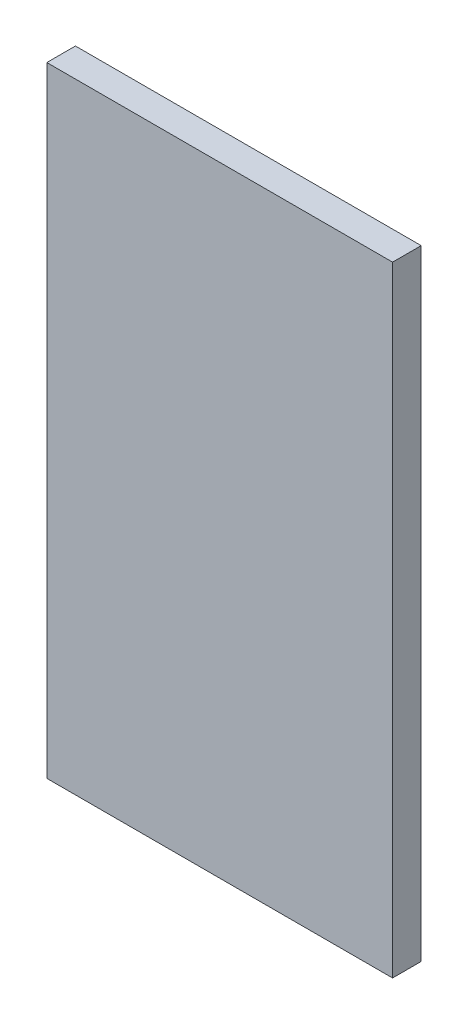
ISO-10303-21;
HEADER;
FILE_DESCRIPTION(('STEP AP214'),'2;1');
FILE_NAME('part.step','',(''),(''),'','','');
FILE_SCHEMA(('AUTOMOTIVE_DESIGN { 1 0 10303 214 1 1 1 1 }'));
ENDSEC;
DATA;
#1=APPLICATION_CONTEXT('core data for automotive mechanical design processes');
#2=APPLICATION_PROTOCOL_DEFINITION('international standard','automotive_design',2000,#1);
#3=PRODUCT_CONTEXT('',#1,'mechanical');
#4=PRODUCT('Part','Part','',(#3));
#5=PRODUCT_RELATED_PRODUCT_CATEGORY('part','',(#4));
#6=PRODUCT_DEFINITION_FORMATION('','',#4);
#7=PRODUCT_DEFINITION_CONTEXT('part definition',#1,'design');
#8=PRODUCT_DEFINITION('design','',#6,#7);
#9=PRODUCT_DEFINITION_SHAPE('','',#8);
#10=(LENGTH_UNIT() NAMED_UNIT(*) SI_UNIT(.MILLI.,.METRE.));
#11=(NAMED_UNIT(*) PLANE_ANGLE_UNIT() SI_UNIT($,.RADIAN.));
#12=(NAMED_UNIT(*) SI_UNIT($,.STERADIAN.) SOLID_ANGLE_UNIT());
#13=UNCERTAINTY_MEASURE_WITH_UNIT(LENGTH_MEASURE(1.E-05),#10,'distance_accuracy_value','');
#14=(GEOMETRIC_REPRESENTATION_CONTEXT(3) GLOBAL_UNCERTAINTY_ASSIGNED_CONTEXT((#13)) GLOBAL_UNIT_ASSIGNED_CONTEXT((#10,
#11,#12)) REPRESENTATION_CONTEXT('',''));
#15=CARTESIAN_POINT('',(0.,0.,0.));
#16=DIRECTION('',(0.,0.,1.));
#17=DIRECTION('',(1.,0.,0.));
#18=AXIS2_PLACEMENT_3D('',#15,#16,#17);
#19=CARTESIAN_POINT('',(-10.0658943507042,33.6236969127037,0.762));
#20=DIRECTION('',(-1.,0.,0.));
#21=DIRECTION('',(0.,-1.,0.));
#22=AXIS2_PLACEMENT_3D('',#19,#20,#21);
#23=PLANE('',#22);
#24=DIRECTION('',(0.,1.,0.));
#25=VECTOR('',#24,1.);
#26=CARTESIAN_POINT('',(-10.0658943507042,33.6236969127037,0.));
#27=LINE('',#26,#25);
#28=CARTESIAN_POINT('',(-10.0658943507042,33.6236969127037,0.));
#29=VERTEX_POINT('',#28);
#30=CARTESIAN_POINT('',(-10.0658943507042,50.1336969127035,0.));
#31=VERTEX_POINT('',#30);
#32=EDGE_CURVE('E95',#29,#31,#27,.T.);
#33=ORIENTED_EDGE('',*,*,#32,.T.);
#34=DIRECTION('',(0.,0.,-1.));
#35=VECTOR('',#34,1.);
#36=CARTESIAN_POINT('',(-10.0658943507042,50.1336969127035,0.762));
#37=LINE('',#36,#35);
#38=CARTESIAN_POINT('',(-10.0658943507042,50.1336969127035,0.762));
#39=VERTEX_POINT('',#38);
#40=EDGE_CURVE('E11',#39,#31,#37,.T.);
#41=ORIENTED_EDGE('',*,*,#40,.F.);
#42=DIRECTION('',(0.,1.,0.));
#43=VECTOR('',#42,1.);
#44=CARTESIAN_POINT('',(-10.0658943507042,33.6236969127037,0.762));
#45=LINE('',#44,#43);
#46=CARTESIAN_POINT('',(-10.0658943507042,33.6236969127037,0.762));
#47=VERTEX_POINT('',#46);
#48=EDGE_CURVE('E83',#47,#39,#45,.T.);
#49=ORIENTED_EDGE('',*,*,#48,.F.);
#50=DIRECTION('',(0.,0.,-1.));
#51=VECTOR('',#50,1.);
#52=CARTESIAN_POINT('',(-10.0658943507042,33.6236969127037,0.762));
#53=LINE('',#52,#51);
#54=EDGE_CURVE('E91',#47,#29,#53,.T.);
#55=ORIENTED_EDGE('',*,*,#54,.T.);
#56=EDGE_LOOP('',(#33,#41,#49,#55));
#57=FACE_BOUND('',#56,.T.);
#58=ADVANCED_FACE('F32',(#57),#23,.F.);
#59=CARTESIAN_POINT('',(-10.0658943507042,50.1336969127035,0.762));
#60=DIRECTION('',(0.,-1.,0.));
#61=DIRECTION('',(0.,0.,-1.));
#62=AXIS2_PLACEMENT_3D('',#59,#60,#61);
#63=PLANE('',#62);
#64=DIRECTION('',(-1.,0.,0.));
#65=VECTOR('',#64,1.);
#66=CARTESIAN_POINT('',(-10.0658943507042,50.1336969127035,0.));
#67=LINE('',#66,#65);
#68=CARTESIAN_POINT('',(-19.2733943507042,50.1336969127035,0.));
#69=VERTEX_POINT('',#68);
#70=EDGE_CURVE('E87',#31,#69,#67,.T.);
#71=ORIENTED_EDGE('',*,*,#70,.T.);
#72=DIRECTION('',(0.,0.,-1.));
#73=VECTOR('',#72,1.);
#74=CARTESIAN_POINT('',(-19.2733943507042,50.1336969127035,0.762));
#75=LINE('',#74,#73);
#76=CARTESIAN_POINT('',(-19.2733943507042,50.1336969127035,0.762));
#77=VERTEX_POINT('',#76);
#78=EDGE_CURVE('E40',#77,#69,#75,.T.);
#79=ORIENTED_EDGE('',*,*,#78,.F.);
#80=DIRECTION('',(-1.,0.,0.));
#81=VECTOR('',#80,1.);
#82=CARTESIAN_POINT('',(-10.0658943507042,50.1336969127035,0.762));
#83=LINE('',#82,#81);
#84=EDGE_CURVE('E78',#39,#77,#83,.T.);
#85=ORIENTED_EDGE('',*,*,#84,.F.);
#86=ORIENTED_EDGE('',*,*,#40,.T.);
#87=EDGE_LOOP('',(#71,#79,#85,#86));
#88=FACE_BOUND('',#87,.T.);
#89=ADVANCED_FACE('F86',(#88),#63,.F.);
#90=CARTESIAN_POINT('',(-19.2733943507042,50.1336969127035,0.762));
#91=DIRECTION('',(1.,0.,0.));
#92=DIRECTION('',(0.,0.,-1.));
#93=AXIS2_PLACEMENT_3D('',#90,#91,#92);
#94=PLANE('',#93);
#95=DIRECTION('',(0.,-1.,0.));
#96=VECTOR('',#95,1.);
#97=CARTESIAN_POINT('',(-19.2733943507042,50.1336969127035,0.));
#98=LINE('',#97,#96);
#99=CARTESIAN_POINT('',(-19.2733943507042,33.6236969127037,0.));
#100=VERTEX_POINT('',#99);
#101=EDGE_CURVE('E65',#69,#100,#98,.T.);
#102=ORIENTED_EDGE('',*,*,#101,.T.);
#103=DIRECTION('',(0.,0.,-1.));
#104=VECTOR('',#103,1.);
#105=CARTESIAN_POINT('',(-19.2733943507042,33.6236969127037,0.762));
#106=LINE('',#105,#104);
#107=CARTESIAN_POINT('',(-19.2733943507042,33.6236969127037,0.762));
#108=VERTEX_POINT('',#107);
#109=EDGE_CURVE('E88',#108,#100,#106,.T.);
#110=ORIENTED_EDGE('',*,*,#109,.F.);
#111=DIRECTION('',(0.,-1.,0.));
#112=VECTOR('',#111,1.);
#113=CARTESIAN_POINT('',(-19.2733943507042,50.1336969127035,0.762));
#114=LINE('',#113,#112);
#115=EDGE_CURVE('E81',#77,#108,#114,.T.);
#116=ORIENTED_EDGE('',*,*,#115,.F.);
#117=ORIENTED_EDGE('',*,*,#78,.T.);
#118=EDGE_LOOP('',(#102,#110,#116,#117));
#119=FACE_BOUND('',#118,.T.);
#120=ADVANCED_FACE('F89',(#119),#94,.F.);
#121=CARTESIAN_POINT('',(-19.2733943507042,33.6236969127037,0.762));
#122=DIRECTION('',(0.,1.,0.));
#123=DIRECTION('',(0.,0.,1.));
#124=AXIS2_PLACEMENT_3D('',#121,#122,#123);
#125=PLANE('',#124);
#126=DIRECTION('',(1.,0.,0.));
#127=VECTOR('',#126,1.);
#128=CARTESIAN_POINT('',(-19.2733943507042,33.6236969127037,0.));
#129=LINE('',#128,#127);
#130=EDGE_CURVE('E71',#100,#29,#129,.T.);
#131=ORIENTED_EDGE('',*,*,#130,.T.);
#132=ORIENTED_EDGE('',*,*,#54,.F.);
#133=DIRECTION('',(1.,0.,0.));
#134=VECTOR('',#133,1.);
#135=CARTESIAN_POINT('',(-19.2733943507042,33.6236969127037,0.762));
#136=LINE('',#135,#134);
#137=EDGE_CURVE('E48',#108,#47,#136,.T.);
#138=ORIENTED_EDGE('',*,*,#137,.F.);
#139=ORIENTED_EDGE('',*,*,#109,.T.);
#140=EDGE_LOOP('',(#131,#132,#138,#139));
#141=FACE_BOUND('',#140,.T.);
#142=ADVANCED_FACE('F102',(#141),#125,.F.);
#143=CARTESIAN_POINT('',(0.,0.,0.762));
#144=DIRECTION('',(0.,0.,1.));
#145=DIRECTION('',(1.,0.,0.));
#146=AXIS2_PLACEMENT_3D('',#143,#144,#145);
#147=PLANE('',#146);
#148=ORIENTED_EDGE('',*,*,#48,.T.);
#149=ORIENTED_EDGE('',*,*,#84,.T.);
#150=ORIENTED_EDGE('',*,*,#115,.T.);
#151=ORIENTED_EDGE('',*,*,#137,.T.);
#152=EDGE_LOOP('',(#148,#149,#150,#151));
#153=FACE_BOUND('',#152,.T.);
#154=ADVANCED_FACE('F79',(#153),#147,.T.);
#155=CARTESIAN_POINT('',(0.,0.,0.));
#156=DIRECTION('',(0.,0.,1.));
#157=DIRECTION('',(1.,0.,0.));
#158=AXIS2_PLACEMENT_3D('',#155,#156,#157);
#159=PLANE('',#158);
#160=ORIENTED_EDGE('',*,*,#32,.F.);
#161=ORIENTED_EDGE('',*,*,#130,.F.);
#162=ORIENTED_EDGE('',*,*,#101,.F.);
#163=ORIENTED_EDGE('',*,*,#70,.F.);
#164=EDGE_LOOP('',(#160,#161,#162,#163));
#165=FACE_BOUND('',#164,.T.);
#166=ADVANCED_FACE('F105',(#165),#159,.F.);
#167=CLOSED_SHELL('',(#58,#89,#120,#142,#154,#166));
#168=MANIFOLD_SOLID_BREP('B2',#167);
#169=ADVANCED_BREP_SHAPE_REPRESENTATION('',(#18,#168),#14);
#170=SHAPE_DEFINITION_REPRESENTATION(#9,#169);
ENDSEC;
END-ISO-10303-21;
